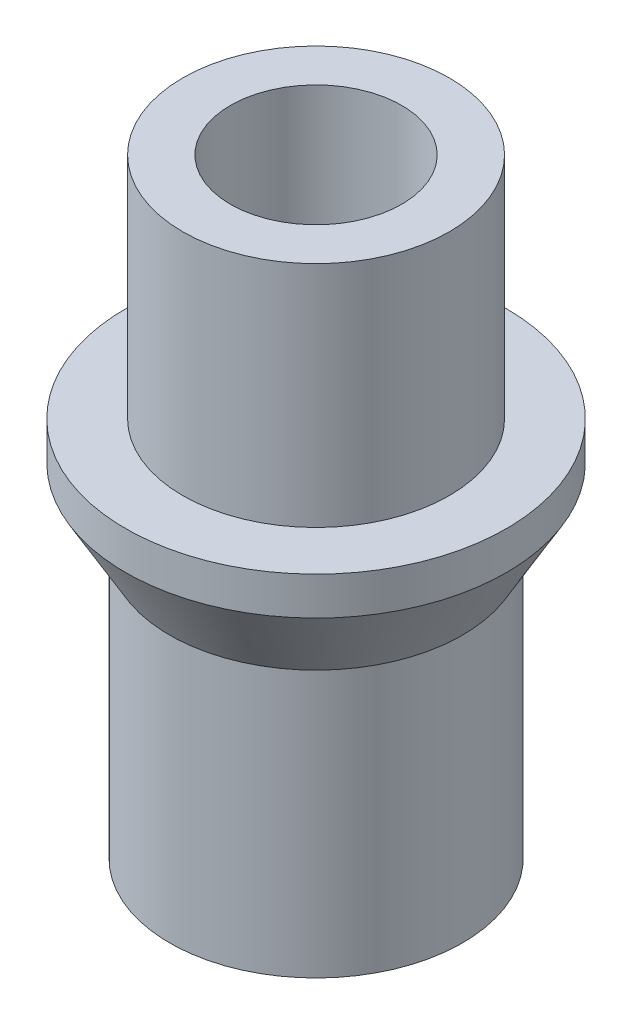
ISO-10303-21;
HEADER;
FILE_DESCRIPTION(('STEP AP214'),'2;1');
FILE_NAME('part.step','',(''),(''),'','','');
FILE_SCHEMA(('AUTOMOTIVE_DESIGN { 1 0 10303 214 1 1 1 1 }'));
ENDSEC;
DATA;
#1=APPLICATION_CONTEXT('core data for automotive mechanical design processes');
#2=APPLICATION_PROTOCOL_DEFINITION('international standard','automotive_design',2000,#1);
#3=PRODUCT_CONTEXT('',#1,'mechanical');
#4=PRODUCT('Part','Part','',(#3));
#5=PRODUCT_RELATED_PRODUCT_CATEGORY('part','',(#4));
#6=PRODUCT_DEFINITION_FORMATION('','',#4);
#7=PRODUCT_DEFINITION_CONTEXT('part definition',#1,'design');
#8=PRODUCT_DEFINITION('design','',#6,#7);
#9=PRODUCT_DEFINITION_SHAPE('','',#8);
#10=(LENGTH_UNIT() NAMED_UNIT(*) SI_UNIT(.MILLI.,.METRE.));
#11=(NAMED_UNIT(*) PLANE_ANGLE_UNIT() SI_UNIT($,.RADIAN.));
#12=(NAMED_UNIT(*) SI_UNIT($,.STERADIAN.) SOLID_ANGLE_UNIT());
#13=UNCERTAINTY_MEASURE_WITH_UNIT(LENGTH_MEASURE(1.E-05),#10,'distance_accuracy_value','');
#14=(GEOMETRIC_REPRESENTATION_CONTEXT(3) GLOBAL_UNCERTAINTY_ASSIGNED_CONTEXT((#13)) GLOBAL_UNIT_ASSIGNED_CONTEXT((#10,
#11,#12)) REPRESENTATION_CONTEXT('',''));
#15=CARTESIAN_POINT('',(0.,0.,0.));
#16=DIRECTION('',(0.,0.,1.));
#17=DIRECTION('',(1.,0.,0.));
#18=AXIS2_PLACEMENT_3D('',#15,#16,#17);
#19=CARTESIAN_POINT('',(0.,-6.,0.));
#20=DIRECTION('',(0.,1.,0.));
#21=DIRECTION('',(0.,0.,1.));
#22=AXIS2_PLACEMENT_3D('',#19,#20,#21);
#23=CYLINDRICAL_SURFACE('',#22,3.5);
#24=CARTESIAN_POINT('',(0.,-6.,0.));
#25=DIRECTION('',(0.,-1.,0.));
#26=DIRECTION('',(0.,0.,-1.));
#27=AXIS2_PLACEMENT_3D('',#24,#25,#26);
#28=CIRCLE('',#27,3.5);
#29=CARTESIAN_POINT('',(0.,-6.,-3.5));
#30=VERTEX_POINT('',#29);
#31=EDGE_CURVE('E48',#30,#30,#28,.F.);
#32=ORIENTED_EDGE('',*,*,#31,.T.);
#33=EDGE_LOOP('',(#32));
#34=FACE_BOUND('',#33,.T.);
#35=CARTESIAN_POINT('',(0.,0.,0.));
#36=DIRECTION('',(0.,1.,0.));
#37=DIRECTION('',(0.,0.,1.));
#38=AXIS2_PLACEMENT_3D('',#35,#36,#37);
#39=CIRCLE('',#38,3.5);
#40=CARTESIAN_POINT('',(0.,0.,3.5));
#41=VERTEX_POINT('',#40);
#42=EDGE_CURVE('E10',#41,#41,#39,.T.);
#43=ORIENTED_EDGE('',*,*,#42,.F.);
#44=EDGE_LOOP('',(#43));
#45=FACE_BOUND('',#44,.T.);
#46=ADVANCED_FACE('F33',(#34,#45),#23,.T.);
#47=CARTESIAN_POINT('',(0.,0.,0.));
#48=DIRECTION('',(0.,1.,0.));
#49=DIRECTION('',(0.,0.,1.));
#50=AXIS2_PLACEMENT_3D('',#47,#48,#49);
#51=PLANE('',#50);
#52=CARTESIAN_POINT('',(0.,0.,0.));
#53=DIRECTION('',(0.,1.,0.));
#54=DIRECTION('',(0.,0.,1.));
#55=AXIS2_PLACEMENT_3D('',#52,#53,#54);
#56=CIRCLE('',#55,2.25);
#57=CARTESIAN_POINT('',(0.,0.,2.25));
#58=VERTEX_POINT('',#57);
#59=EDGE_CURVE('E43',#58,#58,#56,.T.);
#60=ORIENTED_EDGE('',*,*,#59,.F.);
#61=EDGE_LOOP('',(#60));
#62=FACE_BOUND('',#61,.T.);
#63=ORIENTED_EDGE('',*,*,#42,.T.);
#64=EDGE_LOOP('',(#63));
#65=FACE_BOUND('',#64,.T.);
#66=ADVANCED_FACE('F96',(#62,#65),#51,.T.);
#67=CARTESIAN_POINT('',(0.,-6.,0.));
#68=DIRECTION('',(0.,1.,0.));
#69=DIRECTION('',(0.,0.,1.));
#70=AXIS2_PLACEMENT_3D('',#67,#68,#69);
#71=CYLINDRICAL_SURFACE('',#70,2.25);
#72=CARTESIAN_POINT('',(0.,-6.,0.));
#73=DIRECTION('',(0.,1.,0.));
#74=DIRECTION('',(0.,0.,1.));
#75=AXIS2_PLACEMENT_3D('',#72,#73,#74);
#76=CIRCLE('',#75,2.25);
#77=CARTESIAN_POINT('',(0.,-6.,2.25));
#78=VERTEX_POINT('',#77);
#79=EDGE_CURVE('E39',#78,#78,#76,.T.);
#80=ORIENTED_EDGE('',*,*,#79,.F.);
#81=EDGE_LOOP('',(#80));
#82=FACE_BOUND('',#81,.T.);
#83=ORIENTED_EDGE('',*,*,#59,.T.);
#84=EDGE_LOOP('',(#83));
#85=FACE_BOUND('',#84,.T.);
#86=ADVANCED_FACE('F94',(#82,#85),#71,.F.);
#87=CARTESIAN_POINT('',(0.,-6.,0.));
#88=DIRECTION('',(0.,-1.,0.));
#89=DIRECTION('',(0.,0.,-1.));
#90=AXIS2_PLACEMENT_3D('',#87,#88,#89);
#91=PLANE('',#90);
#92=ORIENTED_EDGE('',*,*,#79,.T.);
#93=EDGE_LOOP('',(#92));
#94=FACE_BOUND('',#93,.T.);
#95=ADVANCED_FACE('F83',(#94),#91,.F.);
#96=CARTESIAN_POINT('',(0.,-7.,0.));
#97=DIRECTION('',(0.,1.,0.));
#98=DIRECTION('',(0.,0.,1.));
#99=AXIS2_PLACEMENT_3D('',#96,#97,#98);
#100=CYLINDRICAL_SURFACE('',#99,5.);
#101=CARTESIAN_POINT('',(0.,-7.,0.));
#102=DIRECTION('',(0.,-1.,0.));
#103=DIRECTION('',(0.,0.,-1.));
#104=AXIS2_PLACEMENT_3D('',#101,#102,#103);
#105=CIRCLE('',#104,5.);
#106=CARTESIAN_POINT('',(0.,-7.,-5.));
#107=VERTEX_POINT('',#106);
#108=EDGE_CURVE('E52',#107,#107,#105,.T.);
#109=ORIENTED_EDGE('',*,*,#108,.F.);
#110=EDGE_LOOP('',(#109));
#111=FACE_BOUND('',#110,.T.);
#112=CARTESIAN_POINT('',(0.,-6.,0.));
#113=DIRECTION('',(0.,-1.,0.));
#114=DIRECTION('',(0.,0.,-1.));
#115=AXIS2_PLACEMENT_3D('',#112,#113,#114);
#116=CIRCLE('',#115,5.);
#117=CARTESIAN_POINT('',(0.,-6.,-5.));
#118=VERTEX_POINT('',#117);
#119=EDGE_CURVE('E53',#118,#118,#116,.T.);
#120=ORIENTED_EDGE('',*,*,#119,.T.);
#121=EDGE_LOOP('',(#120));
#122=FACE_BOUND('',#121,.T.);
#123=ADVANCED_FACE('F80',(#111,#122),#100,.T.);
#124=ORIENTED_EDGE('',*,*,#31,.F.);
#125=EDGE_LOOP('',(#124));
#126=FACE_BOUND('',#125,.T.);
#127=ORIENTED_EDGE('',*,*,#119,.F.);
#128=EDGE_LOOP('',(#127));
#129=FACE_BOUND('',#128,.T.);
#130=ADVANCED_FACE('F76',(#126,#129),#91,.F.);
#131=CARTESIAN_POINT('',(0.,-7.,0.));
#132=DIRECTION('',(0.,1.,0.));
#133=DIRECTION('',(0.,0.,-1.));
#134=AXIS2_PLACEMENT_3D('',#131,#132,#133);
#135=CONICAL_SURFACE('',#134,5.,0.523598775598299);
#136=CARTESIAN_POINT('',(0.,-9.,0.));
#137=DIRECTION('',(0.,-1.,0.));
#138=DIRECTION('',(0.,0.,-1.));
#139=AXIS2_PLACEMENT_3D('',#136,#137,#138);
#140=CIRCLE('',#139,3.84529946162075);
#141=CARTESIAN_POINT('',(0.,-9.,-3.84529946162075));
#142=VERTEX_POINT('',#141);
#143=EDGE_CURVE('E56',#142,#142,#140,.T.);
#144=ORIENTED_EDGE('',*,*,#143,.F.);
#145=EDGE_LOOP('',(#144));
#146=FACE_BOUND('',#145,.T.);
#147=ORIENTED_EDGE('',*,*,#108,.T.);
#148=EDGE_LOOP('',(#147));
#149=FACE_BOUND('',#148,.T.);
#150=ADVANCED_FACE('F70',(#146,#149),#135,.T.);
#151=CARTESIAN_POINT('',(0.,-16.,0.));
#152=DIRECTION('',(0.,1.,0.));
#153=DIRECTION('',(0.,0.,1.));
#154=AXIS2_PLACEMENT_3D('',#151,#152,#153);
#155=CYLINDRICAL_SURFACE('',#154,3.84529946162075);
#156=CARTESIAN_POINT('',(0.,-16.,0.));
#157=DIRECTION('',(0.,-1.,0.));
#158=DIRECTION('',(0.,0.,-1.));
#159=AXIS2_PLACEMENT_3D('',#156,#157,#158);
#160=CIRCLE('',#159,3.84529946162075);
#161=CARTESIAN_POINT('',(0.,-16.,-3.84529946162075));
#162=VERTEX_POINT('',#161);
#163=EDGE_CURVE('E61',#162,#162,#160,.T.);
#164=ORIENTED_EDGE('',*,*,#163,.F.);
#165=EDGE_LOOP('',(#164));
#166=FACE_BOUND('',#165,.T.);
#167=ORIENTED_EDGE('',*,*,#143,.T.);
#168=EDGE_LOOP('',(#167));
#169=FACE_BOUND('',#168,.T.);
#170=ADVANCED_FACE('F67',(#166,#169),#155,.T.);
#171=CARTESIAN_POINT('',(0.,-16.,0.));
#172=DIRECTION('',(0.,-1.,0.));
#173=DIRECTION('',(0.,0.,-1.));
#174=AXIS2_PLACEMENT_3D('',#171,#172,#173);
#175=PLANE('',#174);
#176=ORIENTED_EDGE('',*,*,#163,.T.);
#177=EDGE_LOOP('',(#176));
#178=FACE_BOUND('',#177,.T.);
#179=ADVANCED_FACE('F65',(#178),#175,.T.);
#180=CLOSED_SHELL('',(#46,#66,#86,#95,#123,#130,#150,#170,#179));
#181=MANIFOLD_SOLID_BREP('B2',#180);
#182=ADVANCED_BREP_SHAPE_REPRESENTATION('',(#18,#181),#14);
#183=SHAPE_DEFINITION_REPRESENTATION(#9,#182);
ENDSEC;
END-ISO-10303-21;
